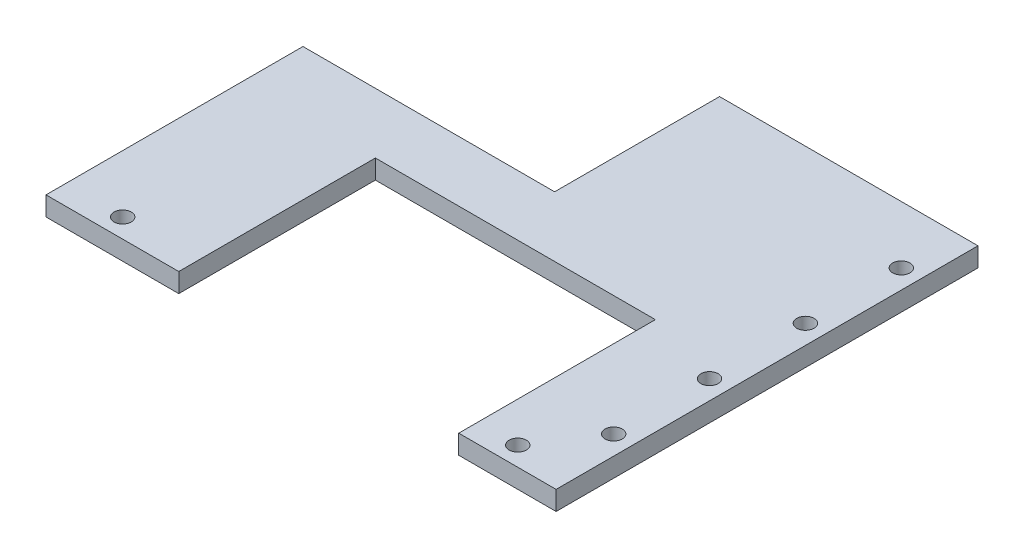
ISO-10303-21;
HEADER;
FILE_DESCRIPTION(('STEP AP214'),'2;1');
FILE_NAME('part.step','',(''),(''),'','','');
FILE_SCHEMA(('AUTOMOTIVE_DESIGN { 1 0 10303 214 1 1 1 1 }'));
ENDSEC;
DATA;
#1=APPLICATION_CONTEXT('core data for automotive mechanical design processes');
#2=APPLICATION_PROTOCOL_DEFINITION('international standard','automotive_design',2000,#1);
#3=PRODUCT_CONTEXT('',#1,'mechanical');
#4=PRODUCT('Part','Part','',(#3));
#5=PRODUCT_RELATED_PRODUCT_CATEGORY('part','',(#4));
#6=PRODUCT_DEFINITION_FORMATION('','',#4);
#7=PRODUCT_DEFINITION_CONTEXT('part definition',#1,'design');
#8=PRODUCT_DEFINITION('design','',#6,#7);
#9=PRODUCT_DEFINITION_SHAPE('','',#8);
#10=(LENGTH_UNIT() NAMED_UNIT(*) SI_UNIT(.MILLI.,.METRE.));
#11=(NAMED_UNIT(*) PLANE_ANGLE_UNIT() SI_UNIT($,.RADIAN.));
#12=(NAMED_UNIT(*) SI_UNIT($,.STERADIAN.) SOLID_ANGLE_UNIT());
#13=UNCERTAINTY_MEASURE_WITH_UNIT(LENGTH_MEASURE(1.E-05),#10,'distance_accuracy_value','');
#14=(GEOMETRIC_REPRESENTATION_CONTEXT(3) GLOBAL_UNCERTAINTY_ASSIGNED_CONTEXT((#13)) GLOBAL_UNIT_ASSIGNED_CONTEXT((#10,
#11,#12)) REPRESENTATION_CONTEXT('',''));
#15=CARTESIAN_POINT('',(0.,0.,0.));
#16=DIRECTION('',(0.,0.,1.));
#17=DIRECTION('',(1.,0.,0.));
#18=AXIS2_PLACEMENT_3D('',#15,#16,#17);
#19=CARTESIAN_POINT('',(-65.6134210190672,5.,54.2667391887022));
#20=DIRECTION('',(0.,0.,-1.));
#21=DIRECTION('',(-1.,0.,0.));
#22=AXIS2_PLACEMENT_3D('',#19,#20,#21);
#23=PLANE('',#22);
#24=DIRECTION('',(1.,0.,0.));
#25=VECTOR('',#24,1.);
#26=CARTESIAN_POINT('',(-65.6134210190672,5.,54.2667391887022));
#27=LINE('',#26,#25);
#28=CARTESIAN_POINT('',(42.,5.,54.2667391887022));
#29=VERTEX_POINT('',#28);
#30=CARTESIAN_POINT('',(67.3865789809328,5.,54.2667391887022));
#31=VERTEX_POINT('',#30);
#32=EDGE_CURVE('E64',#29,#31,#27,.T.);
#33=ORIENTED_EDGE('',*,*,#32,.F.);
#34=DIRECTION('',(0.,1.,0.));
#35=VECTOR('',#34,1.);
#36=CARTESIAN_POINT('',(42.,0.,54.2667391887022));
#37=LINE('',#36,#35);
#38=CARTESIAN_POINT('',(42.,0.,54.2667391887022));
#39=VERTEX_POINT('',#38);
#40=EDGE_CURVE('E213',#39,#29,#37,.T.);
#41=ORIENTED_EDGE('',*,*,#40,.F.);
#42=DIRECTION('',(1.,0.,0.));
#43=VECTOR('',#42,1.);
#44=CARTESIAN_POINT('',(-65.6134210190672,0.,54.2667391887022));
#45=LINE('',#44,#43);
#46=CARTESIAN_POINT('',(67.3865789809328,0.,54.2667391887022));
#47=VERTEX_POINT('',#46);
#48=EDGE_CURVE('E92',#39,#47,#45,.T.);
#49=ORIENTED_EDGE('',*,*,#48,.T.);
#50=DIRECTION('',(0.,-1.,0.));
#51=VECTOR('',#50,1.);
#52=CARTESIAN_POINT('',(67.3865789809328,5.,54.2667391887022));
#53=LINE('',#52,#51);
#54=EDGE_CURVE('E147',#31,#47,#53,.T.);
#55=ORIENTED_EDGE('',*,*,#54,.F.);
#56=EDGE_LOOP('',(#33,#41,#49,#55));
#57=FACE_BOUND('',#56,.T.);
#58=ADVANCED_FACE('F39',(#57),#23,.F.);
#59=CARTESIAN_POINT('',(0.,5.,0.));
#60=DIRECTION('',(0.,1.,0.));
#61=DIRECTION('',(0.,0.,1.));
#62=AXIS2_PLACEMENT_3D('',#59,#60,#61);
#63=PLANE('',#62);
#64=DIRECTION('',(0.,0.,-1.));
#65=VECTOR('',#64,1.);
#66=CARTESIAN_POINT('',(42.,5.,3.));
#67=LINE('',#66,#65);
#68=CARTESIAN_POINT('',(42.,5.,3.));
#69=VERTEX_POINT('',#68);
#70=EDGE_CURVE('E196',#29,#69,#67,.T.);
#71=ORIENTED_EDGE('',*,*,#70,.F.);
#72=ORIENTED_EDGE('',*,*,#32,.T.);
#73=DIRECTION('',(0.,0.,-1.));
#74=VECTOR('',#73,1.);
#75=CARTESIAN_POINT('',(67.3865789809328,5.,-55.7332608112978));
#76=LINE('',#75,#74);
#77=CARTESIAN_POINT('',(67.3865789809328,5.,-55.7332608112978));
#78=VERTEX_POINT('',#77);
#79=EDGE_CURVE('E168',#31,#78,#76,.T.);
#80=ORIENTED_EDGE('',*,*,#79,.T.);
#81=DIRECTION('',(-1.,0.,0.));
#82=VECTOR('',#81,1.);
#83=CARTESIAN_POINT('',(0.,5.,-55.7332608112978));
#84=LINE('',#83,#82);
#85=CARTESIAN_POINT('',(0.,5.,-55.7332608112978));
#86=VERTEX_POINT('',#85);
#87=EDGE_CURVE('E100',#78,#86,#84,.T.);
#88=ORIENTED_EDGE('',*,*,#87,.T.);
#89=DIRECTION('',(0.,0.,1.));
#90=VECTOR('',#89,1.);
#91=CARTESIAN_POINT('',(0.,5.,-55.7332608112978));
#92=LINE('',#91,#90);
#93=CARTESIAN_POINT('',(0.,5.,-12.7332608112978));
#94=VERTEX_POINT('',#93);
#95=EDGE_CURVE('E119',#86,#94,#92,.T.);
#96=ORIENTED_EDGE('',*,*,#95,.T.);
#97=DIRECTION('',(-1.,0.,0.));
#98=VECTOR('',#97,1.);
#99=CARTESIAN_POINT('',(0.,5.,-12.7332608112978));
#100=LINE('',#99,#98);
#101=CARTESIAN_POINT('',(-65.6134210190672,5.,-12.7332608112978));
#102=VERTEX_POINT('',#101);
#103=EDGE_CURVE('E110',#94,#102,#100,.T.);
#104=ORIENTED_EDGE('',*,*,#103,.T.);
#105=DIRECTION('',(0.,0.,1.));
#106=VECTOR('',#105,1.);
#107=CARTESIAN_POINT('',(-65.6134210190672,5.,-12.7332608112978));
#108=LINE('',#107,#106);
#109=CARTESIAN_POINT('',(-65.6134210190672,5.,54.2667391887022));
#110=VERTEX_POINT('',#109);
#111=EDGE_CURVE('E116',#102,#110,#108,.T.);
#112=ORIENTED_EDGE('',*,*,#111,.T.);
#113=CARTESIAN_POINT('',(-31.,5.,54.2667391887022));
#114=VERTEX_POINT('',#113);
#115=EDGE_CURVE('E142',#110,#114,#27,.T.);
#116=ORIENTED_EDGE('',*,*,#115,.T.);
#117=DIRECTION('',(0.,0.,1.));
#118=VECTOR('',#117,1.);
#119=CARTESIAN_POINT('',(-31.,5.,3.));
#120=LINE('',#119,#118);
#121=CARTESIAN_POINT('',(-31.,5.,3.));
#122=VERTEX_POINT('',#121);
#123=EDGE_CURVE('E55',#122,#114,#120,.T.);
#124=ORIENTED_EDGE('',*,*,#123,.F.);
#125=DIRECTION('',(-1.,0.,0.));
#126=VECTOR('',#125,1.);
#127=CARTESIAN_POINT('',(-8.00000000000001,5.,3.));
#128=LINE('',#127,#126);
#129=EDGE_CURVE('E192',#69,#122,#128,.T.);
#130=ORIENTED_EDGE('',*,*,#129,.F.);
#131=EDGE_LOOP('',(#71,#72,#80,#88,#96,#104,#112,#116,#124,#130));
#132=FACE_BOUND('',#131,.T.);
#133=CARTESIAN_POINT('',(-50.6134210190672,5.,49.2667391887022));
#134=DIRECTION('',(0.,1.,0.));
#135=DIRECTION('',(0.,0.,1.));
#136=AXIS2_PLACEMENT_3D('',#133,#134,#135);
#137=CIRCLE('',#136,2.25);
#138=CARTESIAN_POINT('',(-50.6134210190672,5.,51.5167391887022));
#139=VERTEX_POINT('',#138);
#140=EDGE_CURVE('E230',#139,#139,#137,.T.);
#141=ORIENTED_EDGE('',*,*,#140,.F.);
#142=EDGE_LOOP('',(#141));
#143=FACE_BOUND('',#142,.T.);
#144=CARTESIAN_POINT('',(62.3865789809338,5.,34.2667391887022));
#145=DIRECTION('',(0.,1.,0.));
#146=DIRECTION('',(0.,0.,1.));
#147=AXIS2_PLACEMENT_3D('',#144,#145,#146);
#148=CIRCLE('',#147,2.25);
#149=CARTESIAN_POINT('',(62.3865789809338,5.,36.5167391887022));
#150=VERTEX_POINT('',#149);
#151=EDGE_CURVE('E238',#150,#150,#148,.T.);
#152=ORIENTED_EDGE('',*,*,#151,.F.);
#153=EDGE_LOOP('',(#152));
#154=FACE_BOUND('',#153,.T.);
#155=CARTESIAN_POINT('',(62.3865789809331,5.,-15.7332608112978));
#156=DIRECTION('',(0.,1.,0.));
#157=DIRECTION('',(0.,0.,1.));
#158=AXIS2_PLACEMENT_3D('',#155,#156,#157);
#159=CIRCLE('',#158,2.25);
#160=CARTESIAN_POINT('',(62.3865789809331,5.,-13.4832608112978));
#161=VERTEX_POINT('',#160);
#162=EDGE_CURVE('E254',#161,#161,#159,.T.);
#163=ORIENTED_EDGE('',*,*,#162,.F.);
#164=EDGE_LOOP('',(#163));
#165=FACE_BOUND('',#164,.T.);
#166=CARTESIAN_POINT('',(62.3865789809328,5.,-40.7332608112978));
#167=DIRECTION('',(0.,1.,0.));
#168=DIRECTION('',(0.,0.,1.));
#169=AXIS2_PLACEMENT_3D('',#166,#167,#168);
#170=CIRCLE('',#169,2.25);
#171=CARTESIAN_POINT('',(62.3865789809328,5.,-38.4832608112978));
#172=VERTEX_POINT('',#171);
#173=EDGE_CURVE('E153',#172,#172,#170,.T.);
#174=ORIENTED_EDGE('',*,*,#173,.F.);
#175=EDGE_LOOP('',(#174));
#176=FACE_BOUND('',#175,.T.);
#177=CARTESIAN_POINT('',(62.3865789809335,5.,9.26673918870222));
#178=DIRECTION('',(0.,1.,0.));
#179=DIRECTION('',(0.,0.,1.));
#180=AXIS2_PLACEMENT_3D('',#177,#178,#179);
#181=CIRCLE('',#180,2.25);
#182=CARTESIAN_POINT('',(62.3865789809335,5.,11.5167391887022));
#183=VERTEX_POINT('',#182);
#184=EDGE_CURVE('E246',#183,#183,#181,.T.);
#185=ORIENTED_EDGE('',*,*,#184,.F.);
#186=EDGE_LOOP('',(#185));
#187=FACE_BOUND('',#186,.T.);
#188=CARTESIAN_POINT('',(52.3865789809328,5.,49.2667391887022));
#189=DIRECTION('',(0.,1.,0.));
#190=DIRECTION('',(0.,0.,-1.));
#191=AXIS2_PLACEMENT_3D('',#188,#189,#190);
#192=CIRCLE('',#191,2.25);
#193=CARTESIAN_POINT('',(52.3865789809328,5.,47.0167391887022));
#194=VERTEX_POINT('',#193);
#195=EDGE_CURVE('E222',#194,#194,#192,.T.);
#196=ORIENTED_EDGE('',*,*,#195,.F.);
#197=EDGE_LOOP('',(#196));
#198=FACE_BOUND('',#197,.T.);
#199=ADVANCED_FACE('F112',(#132,#143,#154,#165,#176,#187,#198),#63,.T.);
#200=CARTESIAN_POINT('',(0.,0.,0.));
#201=DIRECTION('',(0.,1.,0.));
#202=DIRECTION('',(0.,0.,1.));
#203=AXIS2_PLACEMENT_3D('',#200,#201,#202);
#204=PLANE('',#203);
#205=ORIENTED_EDGE('',*,*,#48,.F.);
#206=DIRECTION('',(0.,0.,-1.));
#207=VECTOR('',#206,1.);
#208=CARTESIAN_POINT('',(42.,0.,3.));
#209=LINE('',#208,#207);
#210=CARTESIAN_POINT('',(42.,0.,3.));
#211=VERTEX_POINT('',#210);
#212=EDGE_CURVE('E202',#39,#211,#209,.T.);
#213=ORIENTED_EDGE('',*,*,#212,.T.);
#214=DIRECTION('',(-1.,0.,0.));
#215=VECTOR('',#214,1.);
#216=CARTESIAN_POINT('',(-31.,0.,3.));
#217=LINE('',#216,#215);
#218=CARTESIAN_POINT('',(-31.,0.,3.));
#219=VERTEX_POINT('',#218);
#220=EDGE_CURVE('E207',#211,#219,#217,.T.);
#221=ORIENTED_EDGE('',*,*,#220,.T.);
#222=DIRECTION('',(0.,0.,1.));
#223=VECTOR('',#222,1.);
#224=CARTESIAN_POINT('',(-31.,0.,3.));
#225=LINE('',#224,#223);
#226=CARTESIAN_POINT('',(-31.,0.,54.2667391887022));
#227=VERTEX_POINT('',#226);
#228=EDGE_CURVE('E276',#219,#227,#225,.T.);
#229=ORIENTED_EDGE('',*,*,#228,.T.);
#230=CARTESIAN_POINT('',(-65.6134210190672,0.,54.2667391887022));
#231=VERTEX_POINT('',#230);
#232=EDGE_CURVE('E164',#231,#227,#45,.T.);
#233=ORIENTED_EDGE('',*,*,#232,.F.);
#234=DIRECTION('',(0.,0.,1.));
#235=VECTOR('',#234,1.);
#236=CARTESIAN_POINT('',(-65.6134210190672,0.,-12.7332608112978));
#237=LINE('',#236,#235);
#238=CARTESIAN_POINT('',(-65.6134210190672,0.,-12.7332608112978));
#239=VERTEX_POINT('',#238);
#240=EDGE_CURVE('E161',#239,#231,#237,.T.);
#241=ORIENTED_EDGE('',*,*,#240,.F.);
#242=DIRECTION('',(-1.,0.,0.));
#243=VECTOR('',#242,1.);
#244=CARTESIAN_POINT('',(0.,0.,-12.7332608112978));
#245=LINE('',#244,#243);
#246=CARTESIAN_POINT('',(0.,0.,-12.7332608112978));
#247=VERTEX_POINT('',#246);
#248=EDGE_CURVE('E129',#247,#239,#245,.T.);
#249=ORIENTED_EDGE('',*,*,#248,.F.);
#250=DIRECTION('',(0.,0.,1.));
#251=VECTOR('',#250,1.);
#252=CARTESIAN_POINT('',(0.,0.,-55.7332608112978));
#253=LINE('',#252,#251);
#254=CARTESIAN_POINT('',(0.,0.,-55.7332608112978));
#255=VERTEX_POINT('',#254);
#256=EDGE_CURVE('E156',#255,#247,#253,.T.);
#257=ORIENTED_EDGE('',*,*,#256,.F.);
#258=DIRECTION('',(-1.,0.,0.));
#259=VECTOR('',#258,1.);
#260=CARTESIAN_POINT('',(0.,0.,-55.7332608112978));
#261=LINE('',#260,#259);
#262=CARTESIAN_POINT('',(67.3865789809328,0.,-55.7332608112978));
#263=VERTEX_POINT('',#262);
#264=EDGE_CURVE('E152',#263,#255,#261,.T.);
#265=ORIENTED_EDGE('',*,*,#264,.F.);
#266=DIRECTION('',(0.,0.,-1.));
#267=VECTOR('',#266,1.);
#268=CARTESIAN_POINT('',(67.3865789809328,0.,-55.7332608112978));
#269=LINE('',#268,#267);
#270=EDGE_CURVE('E148',#47,#263,#269,.T.);
#271=ORIENTED_EDGE('',*,*,#270,.F.);
#272=EDGE_LOOP('',(#205,#213,#221,#229,#233,#241,#249,#257,#265,#271));
#273=FACE_BOUND('',#272,.T.);
#274=CARTESIAN_POINT('',(62.3865789809328,0.,-40.7332608112978));
#275=DIRECTION('',(0.,1.,0.));
#276=DIRECTION('',(0.,0.,1.));
#277=AXIS2_PLACEMENT_3D('',#274,#275,#276);
#278=CIRCLE('',#277,2.25);
#279=CARTESIAN_POINT('',(62.3865789809328,0.,-38.4832608112978));
#280=VERTEX_POINT('',#279);
#281=EDGE_CURVE('E258',#280,#280,#278,.T.);
#282=ORIENTED_EDGE('',*,*,#281,.T.);
#283=EDGE_LOOP('',(#282));
#284=FACE_BOUND('',#283,.T.);
#285=CARTESIAN_POINT('',(62.3865789809331,0.,-15.7332608112978));
#286=DIRECTION('',(0.,1.,0.));
#287=DIRECTION('',(0.,0.,1.));
#288=AXIS2_PLACEMENT_3D('',#285,#286,#287);
#289=CIRCLE('',#288,2.25);
#290=CARTESIAN_POINT('',(62.3865789809331,0.,-13.4832608112978));
#291=VERTEX_POINT('',#290);
#292=EDGE_CURVE('E250',#291,#291,#289,.T.);
#293=ORIENTED_EDGE('',*,*,#292,.T.);
#294=EDGE_LOOP('',(#293));
#295=FACE_BOUND('',#294,.T.);
#296=CARTESIAN_POINT('',(62.3865789809335,0.,9.26673918870222));
#297=DIRECTION('',(0.,1.,0.));
#298=DIRECTION('',(0.,0.,1.));
#299=AXIS2_PLACEMENT_3D('',#296,#297,#298);
#300=CIRCLE('',#299,2.25);
#301=CARTESIAN_POINT('',(62.3865789809335,0.,11.5167391887022));
#302=VERTEX_POINT('',#301);
#303=EDGE_CURVE('E242',#302,#302,#300,.T.);
#304=ORIENTED_EDGE('',*,*,#303,.T.);
#305=EDGE_LOOP('',(#304));
#306=FACE_BOUND('',#305,.T.);
#307=CARTESIAN_POINT('',(62.3865789809338,0.,34.2667391887022));
#308=DIRECTION('',(0.,1.,0.));
#309=DIRECTION('',(0.,0.,1.));
#310=AXIS2_PLACEMENT_3D('',#307,#308,#309);
#311=CIRCLE('',#310,2.25);
#312=CARTESIAN_POINT('',(62.3865789809338,0.,36.5167391887022));
#313=VERTEX_POINT('',#312);
#314=EDGE_CURVE('E234',#313,#313,#311,.T.);
#315=ORIENTED_EDGE('',*,*,#314,.T.);
#316=EDGE_LOOP('',(#315));
#317=FACE_BOUND('',#316,.T.);
#318=CARTESIAN_POINT('',(-50.6134210190672,0.,49.2667391887022));
#319=DIRECTION('',(0.,1.,0.));
#320=DIRECTION('',(0.,0.,1.));
#321=AXIS2_PLACEMENT_3D('',#318,#319,#320);
#322=CIRCLE('',#321,2.25);
#323=CARTESIAN_POINT('',(-50.6134210190672,0.,51.5167391887022));
#324=VERTEX_POINT('',#323);
#325=EDGE_CURVE('E226',#324,#324,#322,.T.);
#326=ORIENTED_EDGE('',*,*,#325,.T.);
#327=EDGE_LOOP('',(#326));
#328=FACE_BOUND('',#327,.T.);
#329=CARTESIAN_POINT('',(52.3865789809328,0.,49.2667391887022));
#330=DIRECTION('',(0.,1.,0.));
#331=DIRECTION('',(0.,0.,-1.));
#332=AXIS2_PLACEMENT_3D('',#329,#330,#331);
#333=CIRCLE('',#332,2.25);
#334=CARTESIAN_POINT('',(52.3865789809328,0.,47.0167391887022));
#335=VERTEX_POINT('',#334);
#336=EDGE_CURVE('E212',#335,#335,#333,.T.);
#337=ORIENTED_EDGE('',*,*,#336,.T.);
#338=EDGE_LOOP('',(#337));
#339=FACE_BOUND('',#338,.T.);
#340=ADVANCED_FACE('F180',(#273,#284,#295,#306,#317,#328,#339),#204,.F.);
#341=CARTESIAN_POINT('',(67.3865789809328,5.,-55.7332608112978));
#342=DIRECTION('',(-1.,0.,0.));
#343=DIRECTION('',(0.,0.,1.));
#344=AXIS2_PLACEMENT_3D('',#341,#342,#343);
#345=PLANE('',#344);
#346=ORIENTED_EDGE('',*,*,#270,.T.);
#347=DIRECTION('',(0.,-1.,0.));
#348=VECTOR('',#347,1.);
#349=CARTESIAN_POINT('',(67.3865789809328,5.,-55.7332608112978));
#350=LINE('',#349,#348);
#351=EDGE_CURVE('E11',#78,#263,#350,.T.);
#352=ORIENTED_EDGE('',*,*,#351,.F.);
#353=ORIENTED_EDGE('',*,*,#79,.F.);
#354=ORIENTED_EDGE('',*,*,#54,.T.);
#355=EDGE_LOOP('',(#346,#352,#353,#354));
#356=FACE_BOUND('',#355,.T.);
#357=ADVANCED_FACE('F41',(#356),#345,.F.);
#358=CARTESIAN_POINT('',(0.,5.,-55.7332608112978));
#359=DIRECTION('',(0.,0.,1.));
#360=DIRECTION('',(1.,0.,0.));
#361=AXIS2_PLACEMENT_3D('',#358,#359,#360);
#362=PLANE('',#361);
#363=ORIENTED_EDGE('',*,*,#264,.T.);
#364=DIRECTION('',(0.,-1.,0.));
#365=VECTOR('',#364,1.);
#366=CARTESIAN_POINT('',(0.,5.,-55.7332608112978));
#367=LINE('',#366,#365);
#368=EDGE_CURVE('E48',#86,#255,#367,.T.);
#369=ORIENTED_EDGE('',*,*,#368,.F.);
#370=ORIENTED_EDGE('',*,*,#87,.F.);
#371=ORIENTED_EDGE('',*,*,#351,.T.);
#372=EDGE_LOOP('',(#363,#369,#370,#371));
#373=FACE_BOUND('',#372,.T.);
#374=ADVANCED_FACE('F296',(#373),#362,.F.);
#375=CARTESIAN_POINT('',(0.,5.,-55.7332608112978));
#376=DIRECTION('',(1.,0.,0.));
#377=DIRECTION('',(0.,0.,-1.));
#378=AXIS2_PLACEMENT_3D('',#375,#376,#377);
#379=PLANE('',#378);
#380=ORIENTED_EDGE('',*,*,#256,.T.);
#381=DIRECTION('',(0.,-1.,0.));
#382=VECTOR('',#381,1.);
#383=CARTESIAN_POINT('',(0.,5.,-12.7332608112978));
#384=LINE('',#383,#382);
#385=EDGE_CURVE('E133',#94,#247,#384,.T.);
#386=ORIENTED_EDGE('',*,*,#385,.F.);
#387=ORIENTED_EDGE('',*,*,#95,.F.);
#388=ORIENTED_EDGE('',*,*,#368,.T.);
#389=EDGE_LOOP('',(#380,#386,#387,#388));
#390=FACE_BOUND('',#389,.T.);
#391=ADVANCED_FACE('F178',(#390),#379,.F.);
#392=CARTESIAN_POINT('',(0.,5.,-12.7332608112978));
#393=DIRECTION('',(0.,0.,1.));
#394=DIRECTION('',(1.,0.,0.));
#395=AXIS2_PLACEMENT_3D('',#392,#393,#394);
#396=PLANE('',#395);
#397=ORIENTED_EDGE('',*,*,#248,.T.);
#398=DIRECTION('',(0.,-1.,0.));
#399=VECTOR('',#398,1.);
#400=CARTESIAN_POINT('',(-65.6134210190672,5.,-12.7332608112978));
#401=LINE('',#400,#399);
#402=EDGE_CURVE('E126',#102,#239,#401,.T.);
#403=ORIENTED_EDGE('',*,*,#402,.F.);
#404=ORIENTED_EDGE('',*,*,#103,.F.);
#405=ORIENTED_EDGE('',*,*,#385,.T.);
#406=EDGE_LOOP('',(#397,#403,#404,#405));
#407=FACE_BOUND('',#406,.T.);
#408=ADVANCED_FACE('F127',(#407),#396,.F.);
#409=CARTESIAN_POINT('',(-65.6134210190672,5.,-12.7332608112978));
#410=DIRECTION('',(1.,0.,0.));
#411=DIRECTION('',(0.,0.,-1.));
#412=AXIS2_PLACEMENT_3D('',#409,#410,#411);
#413=PLANE('',#412);
#414=ORIENTED_EDGE('',*,*,#240,.T.);
#415=DIRECTION('',(0.,-1.,0.));
#416=VECTOR('',#415,1.);
#417=CARTESIAN_POINT('',(-65.6134210190672,5.,54.2667391887022));
#418=LINE('',#417,#416);
#419=EDGE_CURVE('E134',#110,#231,#418,.T.);
#420=ORIENTED_EDGE('',*,*,#419,.F.);
#421=ORIENTED_EDGE('',*,*,#111,.F.);
#422=ORIENTED_EDGE('',*,*,#402,.T.);
#423=EDGE_LOOP('',(#414,#420,#421,#422));
#424=FACE_BOUND('',#423,.T.);
#425=ADVANCED_FACE('F136',(#424),#413,.F.);
#426=ORIENTED_EDGE('',*,*,#232,.T.);
#427=DIRECTION('',(0.,1.,0.));
#428=VECTOR('',#427,1.);
#429=CARTESIAN_POINT('',(-31.,0.,54.2667391887022));
#430=LINE('',#429,#428);
#431=EDGE_CURVE('E188',#227,#114,#430,.T.);
#432=ORIENTED_EDGE('',*,*,#431,.T.);
#433=ORIENTED_EDGE('',*,*,#115,.F.);
#434=ORIENTED_EDGE('',*,*,#419,.T.);
#435=EDGE_LOOP('',(#426,#432,#433,#434));
#436=FACE_BOUND('',#435,.T.);
#437=ADVANCED_FACE('F186',(#436),#23,.F.);
#438=CARTESIAN_POINT('',(62.3865789809328,5.,-40.7332608112978));
#439=DIRECTION('',(0.,-1.,0.));
#440=DIRECTION('',(0.,0.,-1.));
#441=AXIS2_PLACEMENT_3D('',#438,#439,#440);
#442=CYLINDRICAL_SURFACE('',#441,2.25);
#443=ORIENTED_EDGE('',*,*,#173,.T.);
#444=EDGE_LOOP('',(#443));
#445=FACE_BOUND('',#444,.T.);
#446=ORIENTED_EDGE('',*,*,#281,.F.);
#447=EDGE_LOOP('',(#446));
#448=FACE_BOUND('',#447,.T.);
#449=ADVANCED_FACE('F312',(#445,#448),#442,.F.);
#450=CARTESIAN_POINT('',(62.3865789809331,5.,-15.7332608112978));
#451=DIRECTION('',(0.,-1.,0.));
#452=DIRECTION('',(0.,0.,-1.));
#453=AXIS2_PLACEMENT_3D('',#450,#451,#452);
#454=CYLINDRICAL_SURFACE('',#453,2.25);
#455=ORIENTED_EDGE('',*,*,#162,.T.);
#456=EDGE_LOOP('',(#455));
#457=FACE_BOUND('',#456,.T.);
#458=ORIENTED_EDGE('',*,*,#292,.F.);
#459=EDGE_LOOP('',(#458));
#460=FACE_BOUND('',#459,.T.);
#461=ADVANCED_FACE('F317',(#457,#460),#454,.F.);
#462=CARTESIAN_POINT('',(62.3865789809335,5.,9.26673918870222));
#463=DIRECTION('',(0.,-1.,0.));
#464=DIRECTION('',(0.,0.,-1.));
#465=AXIS2_PLACEMENT_3D('',#462,#463,#464);
#466=CYLINDRICAL_SURFACE('',#465,2.25);
#467=ORIENTED_EDGE('',*,*,#184,.T.);
#468=EDGE_LOOP('',(#467));
#469=FACE_BOUND('',#468,.T.);
#470=ORIENTED_EDGE('',*,*,#303,.F.);
#471=EDGE_LOOP('',(#470));
#472=FACE_BOUND('',#471,.T.);
#473=ADVANCED_FACE('F387',(#469,#472),#466,.F.);
#474=CARTESIAN_POINT('',(62.3865789809338,5.,34.2667391887022));
#475=DIRECTION('',(0.,-1.,0.));
#476=DIRECTION('',(0.,0.,-1.));
#477=AXIS2_PLACEMENT_3D('',#474,#475,#476);
#478=CYLINDRICAL_SURFACE('',#477,2.25);
#479=ORIENTED_EDGE('',*,*,#151,.T.);
#480=EDGE_LOOP('',(#479));
#481=FACE_BOUND('',#480,.T.);
#482=ORIENTED_EDGE('',*,*,#314,.F.);
#483=EDGE_LOOP('',(#482));
#484=FACE_BOUND('',#483,.T.);
#485=ADVANCED_FACE('F377',(#481,#484),#478,.F.);
#486=CARTESIAN_POINT('',(-50.6134210190672,5.,49.2667391887022));
#487=DIRECTION('',(0.,-1.,0.));
#488=DIRECTION('',(0.,0.,-1.));
#489=AXIS2_PLACEMENT_3D('',#486,#487,#488);
#490=CYLINDRICAL_SURFACE('',#489,2.25);
#491=ORIENTED_EDGE('',*,*,#140,.T.);
#492=EDGE_LOOP('',(#491));
#493=FACE_BOUND('',#492,.T.);
#494=ORIENTED_EDGE('',*,*,#325,.F.);
#495=EDGE_LOOP('',(#494));
#496=FACE_BOUND('',#495,.T.);
#497=ADVANCED_FACE('F366',(#493,#496),#490,.F.);
#498=CARTESIAN_POINT('',(52.3865789809328,5.,49.2667391887022));
#499=DIRECTION('',(0.,-1.,0.));
#500=DIRECTION('',(0.,0.,-1.));
#501=AXIS2_PLACEMENT_3D('',#498,#499,#500);
#502=CYLINDRICAL_SURFACE('',#501,2.25);
#503=ORIENTED_EDGE('',*,*,#195,.T.);
#504=EDGE_LOOP('',(#503));
#505=FACE_BOUND('',#504,.T.);
#506=ORIENTED_EDGE('',*,*,#336,.F.);
#507=EDGE_LOOP('',(#506));
#508=FACE_BOUND('',#507,.T.);
#509=ADVANCED_FACE('F362',(#505,#508),#502,.F.);
#510=CARTESIAN_POINT('',(-8.00000000000001,0.,3.));
#511=DIRECTION('',(0.,0.,-1.));
#512=DIRECTION('',(-1.,0.,0.));
#513=AXIS2_PLACEMENT_3D('',#510,#511,#512);
#514=PLANE('',#513);
#515=ORIENTED_EDGE('',*,*,#129,.T.);
#516=DIRECTION('',(0.,1.,0.));
#517=VECTOR('',#516,1.);
#518=CARTESIAN_POINT('',(-31.,0.,3.));
#519=LINE('',#518,#517);
#520=EDGE_CURVE('E219',#219,#122,#519,.T.);
#521=ORIENTED_EDGE('',*,*,#520,.F.);
#522=ORIENTED_EDGE('',*,*,#220,.F.);
#523=DIRECTION('',(0.,1.,0.));
#524=VECTOR('',#523,1.);
#525=CARTESIAN_POINT('',(42.,0.,3.));
#526=LINE('',#525,#524);
#527=EDGE_CURVE('E208',#211,#69,#526,.T.);
#528=ORIENTED_EDGE('',*,*,#527,.T.);
#529=EDGE_LOOP('',(#515,#521,#522,#528));
#530=FACE_BOUND('',#529,.T.);
#531=ADVANCED_FACE('F288',(#530),#514,.F.);
#532=CARTESIAN_POINT('',(42.,0.,3.));
#533=DIRECTION('',(1.,0.,0.));
#534=DIRECTION('',(0.,0.,-1.));
#535=AXIS2_PLACEMENT_3D('',#532,#533,#534);
#536=PLANE('',#535);
#537=ORIENTED_EDGE('',*,*,#70,.T.);
#538=ORIENTED_EDGE('',*,*,#527,.F.);
#539=ORIENTED_EDGE('',*,*,#212,.F.);
#540=ORIENTED_EDGE('',*,*,#40,.T.);
#541=EDGE_LOOP('',(#537,#538,#539,#540));
#542=FACE_BOUND('',#541,.T.);
#543=ADVANCED_FACE('F292',(#542),#536,.F.);
#544=CARTESIAN_POINT('',(-31.,0.,3.));
#545=DIRECTION('',(-1.,0.,0.));
#546=DIRECTION('',(0.,0.,1.));
#547=AXIS2_PLACEMENT_3D('',#544,#545,#546);
#548=PLANE('',#547);
#549=ORIENTED_EDGE('',*,*,#123,.T.);
#550=ORIENTED_EDGE('',*,*,#431,.F.);
#551=ORIENTED_EDGE('',*,*,#228,.F.);
#552=ORIENTED_EDGE('',*,*,#520,.T.);
#553=EDGE_LOOP('',(#549,#550,#551,#552));
#554=FACE_BOUND('',#553,.T.);
#555=ADVANCED_FACE('F438',(#554),#548,.F.);
#556=CLOSED_SHELL('',(#58,#199,#340,#357,#374,#391,#408,#425,#437,#449,#461,#473,#485,#497,#509,
#531,#543,#555));
#557=MANIFOLD_SOLID_BREP('B2',#556);
#558=ADVANCED_BREP_SHAPE_REPRESENTATION('',(#18,#557),#14);
#559=SHAPE_DEFINITION_REPRESENTATION(#9,#558);
ENDSEC;
END-ISO-10303-21;
